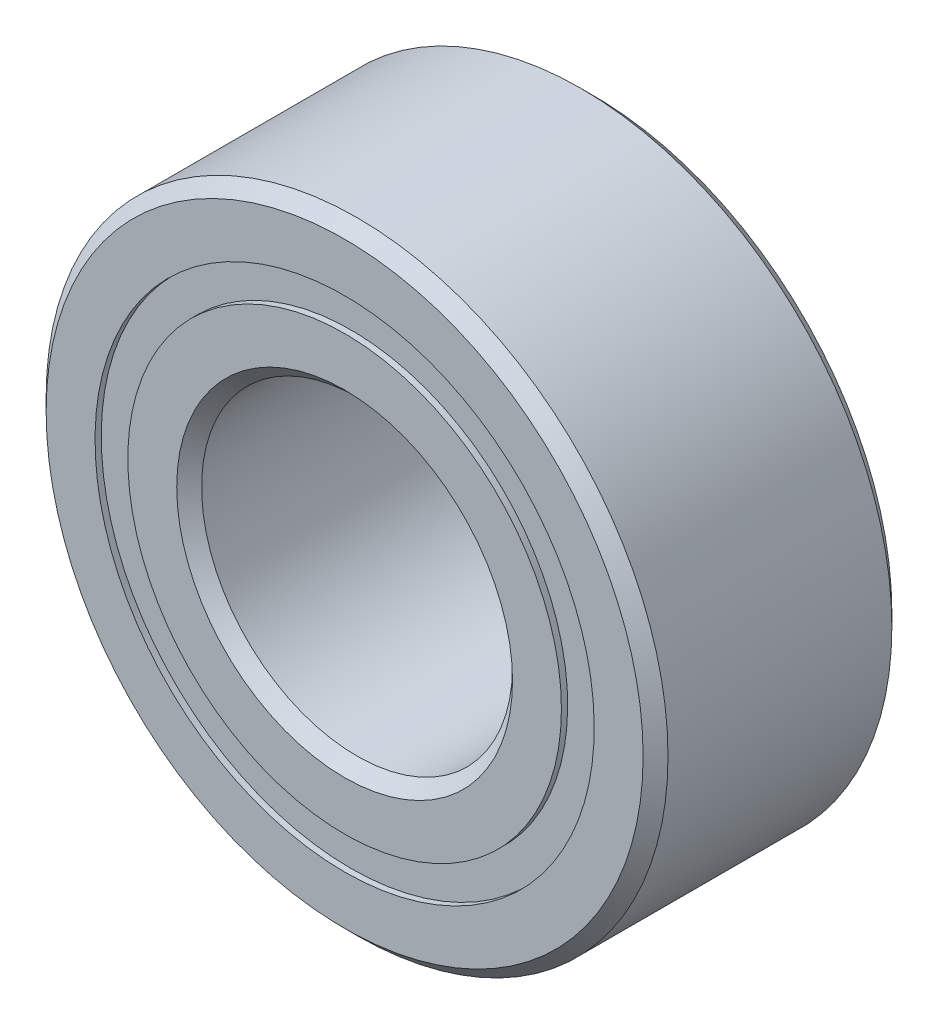
ISO-10303-21;
HEADER;
FILE_DESCRIPTION(('STEP AP214'),'2;1');
FILE_NAME('part.step','',(''),(''),'','','');
FILE_SCHEMA(('AUTOMOTIVE_DESIGN { 1 0 10303 214 1 1 1 1 }'));
ENDSEC;
DATA;
#1=APPLICATION_CONTEXT('core data for automotive mechanical design processes');
#2=APPLICATION_PROTOCOL_DEFINITION('international standard','automotive_design',2000,#1);
#3=PRODUCT_CONTEXT('',#1,'mechanical');
#4=PRODUCT('Part','Part','',(#3));
#5=PRODUCT_RELATED_PRODUCT_CATEGORY('part','',(#4));
#6=PRODUCT_DEFINITION_FORMATION('','',#4);
#7=PRODUCT_DEFINITION_CONTEXT('part definition',#1,'design');
#8=PRODUCT_DEFINITION('design','',#6,#7);
#9=PRODUCT_DEFINITION_SHAPE('','',#8);
#10=(LENGTH_UNIT() NAMED_UNIT(*) SI_UNIT(.MILLI.,.METRE.));
#11=(NAMED_UNIT(*) PLANE_ANGLE_UNIT() SI_UNIT($,.RADIAN.));
#12=(NAMED_UNIT(*) SI_UNIT($,.STERADIAN.) SOLID_ANGLE_UNIT());
#13=UNCERTAINTY_MEASURE_WITH_UNIT(LENGTH_MEASURE(1.E-05),#10,'distance_accuracy_value','');
#14=(GEOMETRIC_REPRESENTATION_CONTEXT(3) GLOBAL_UNCERTAINTY_ASSIGNED_CONTEXT((#13)) GLOBAL_UNIT_ASSIGNED_CONTEXT((#10,
#11,#12)) REPRESENTATION_CONTEXT('',''));
#15=CARTESIAN_POINT('',(0.,0.,0.));
#16=DIRECTION('',(0.,0.,1.));
#17=DIRECTION('',(1.,0.,0.));
#18=AXIS2_PLACEMENT_3D('',#15,#16,#17);
#19=CARTESIAN_POINT('',(0.,3.75,0.927189449));
#20=CARTESIAN_POINT('',(0.,5.604378898,0.927189449));
#21=CARTESIAN_POINT('',(0.,5.604378898,-0.927189449));
#22=CARTESIAN_POINT('',(0.,3.75,-0.927189449));
#23=(BOUNDED_CURVE() B_SPLINE_CURVE(3,(#19,#20,#21,#22),.UNSPECIFIED.,.F.,
.F.) B_SPLINE_CURVE_WITH_KNOTS((4,4),(0.,1.),
.UNSPECIFIED.) CURVE() GEOMETRIC_REPRESENTATION_ITEM() RATIONAL_B_SPLINE_CURVE((1.,
0.333333333333333,0.333333333333333,1.)) REPRESENTATION_ITEM(''));
#24=CARTESIAN_POINT('',(0.,3.75,0.));
#25=DIRECTION('',(0.,0.,1.));
#26=AXIS1_PLACEMENT('',#24,#25);
#27=SURFACE_OF_REVOLUTION('',#23,#26);
#28=CARTESIAN_POINT('',(0.,3.75,-0.927189449));
#29=VERTEX_POINT('',#28);
#30=VERTEX_LOOP('',#29);
#31=FACE_BOUND('',#30,.T.);
#32=CARTESIAN_POINT('',(0.,3.75,0.927189449));
#33=VERTEX_POINT('',#32);
#34=VERTEX_LOOP('',#33);
#35=FACE_BOUND('',#34,.T.);
#36=ADVANCED_FACE('P0_F15',(#31,#35),#27,.F.);
#37=CLOSED_SHELL('',(#36));
#38=MANIFOLD_SOLID_BREP('P0_B1',#37);
#39=CARTESIAN_POINT('',(0.,0.,-1.8));
#40=DIRECTION('',(0.,0.,-1.));
#41=DIRECTION('',(-1.,0.,0.));
#42=AXIS2_PLACEMENT_3D('',#39,#40,#41);
#43=CONICAL_SURFACE('',#42,2.5,0.785398163397449);
#44=CARTESIAN_POINT('',(0.,0.,-1.8));
#45=DIRECTION('',(0.,0.,1.));
#46=DIRECTION('',(1.,0.,0.));
#47=AXIS2_PLACEMENT_3D('',#44,#45,#46);
#48=CIRCLE('',#47,2.5);
#49=CARTESIAN_POINT('',(2.5,0.,-1.8));
#50=VERTEX_POINT('',#49);
#51=EDGE_CURVE('P1_E32',#50,#50,#48,.F.);
#52=ORIENTED_EDGE('',*,*,#51,.F.);
#53=EDGE_LOOP('',(#52));
#54=FACE_BOUND('',#53,.T.);
#55=CARTESIAN_POINT('',(0.,0.,-1.99999999999989));
#56=DIRECTION('',(0.,0.,-1.));
#57=DIRECTION('',(-1.,0.,0.));
#58=AXIS2_PLACEMENT_3D('',#55,#56,#57);
#59=CIRCLE('',#58,2.69999999999989);
#60=CARTESIAN_POINT('',(-2.69999999999989,0.,-1.99999999999989));
#61=VERTEX_POINT('',#60);
#62=EDGE_CURVE('P1_E17',#61,#61,#59,.F.);
#63=ORIENTED_EDGE('',*,*,#62,.F.);
#64=EDGE_LOOP('',(#63));
#65=FACE_BOUND('',#64,.T.);
#66=ADVANCED_FACE('P1_F14',(#54,#65),#43,.F.);
#67=CARTESIAN_POINT('',(0.,0.,-1.8));
#68=DIRECTION('',(0.,0.,1.));
#69=DIRECTION('',(1.,0.,0.));
#70=AXIS2_PLACEMENT_3D('',#67,#68,#69);
#71=CYLINDRICAL_SURFACE('',#70,2.5);
#72=CARTESIAN_POINT('',(0.,0.,1.80000000000002));
#73=DIRECTION('',(0.,0.,1.));
#74=DIRECTION('',(1.,0.,0.));
#75=AXIS2_PLACEMENT_3D('',#72,#73,#74);
#76=CIRCLE('',#75,2.5);
#77=CARTESIAN_POINT('',(2.5,0.,1.8));
#78=VERTEX_POINT('',#77);
#79=EDGE_CURVE('P1_E30',#78,#78,#76,.F.);
#80=ORIENTED_EDGE('',*,*,#79,.F.);
#81=EDGE_LOOP('',(#80));
#82=FACE_BOUND('',#81,.T.);
#83=ORIENTED_EDGE('',*,*,#51,.T.);
#84=EDGE_LOOP('',(#83));
#85=FACE_BOUND('',#84,.T.);
#86=ADVANCED_FACE('P1_F56',(#82,#85),#71,.F.);
#87=CARTESIAN_POINT('',(0.,2.7,-2.));
#88=DIRECTION('',(0.,0.,1.));
#89=DIRECTION('',(1.,0.,0.));
#90=AXIS2_PLACEMENT_3D('',#87,#88,#89);
#91=PLANE('',#90);
#92=ORIENTED_EDGE('',*,*,#62,.T.);
#93=EDGE_LOOP('',(#92));
#94=FACE_BOUND('',#93,.T.);
#95=CARTESIAN_POINT('',(0.,0.,-2.));
#96=DIRECTION('',(0.,0.,1.));
#97=DIRECTION('',(0.,-1.,0.));
#98=AXIS2_PLACEMENT_3D('',#95,#96,#97);
#99=CIRCLE('',#98,3.486263736);
#100=CARTESIAN_POINT('',(0.,-3.486263736,-2.));
#101=VERTEX_POINT('',#100);
#102=EDGE_CURVE('P1_E42',#101,#101,#99,.T.);
#103=ORIENTED_EDGE('',*,*,#102,.F.);
#104=EDGE_LOOP('',(#103));
#105=FACE_BOUND('',#104,.T.);
#106=ADVANCED_FACE('P1_F52',(#94,#105),#91,.F.);
#107=CARTESIAN_POINT('',(0.,0.,1.8));
#108=DIRECTION('',(0.,0.,1.));
#109=DIRECTION('',(1.,0.,0.));
#110=AXIS2_PLACEMENT_3D('',#107,#108,#109);
#111=CONICAL_SURFACE('',#110,2.5,0.785398163397449);
#112=CARTESIAN_POINT('',(0.,0.,2.));
#113=DIRECTION('',(0.,0.,1.));
#114=DIRECTION('',(1.,0.,0.));
#115=AXIS2_PLACEMENT_3D('',#112,#113,#114);
#116=CIRCLE('',#115,2.7);
#117=CARTESIAN_POINT('',(2.7,0.,2.));
#118=VERTEX_POINT('',#117);
#119=EDGE_CURVE('P1_E38',#118,#118,#116,.F.);
#120=ORIENTED_EDGE('',*,*,#119,.F.);
#121=EDGE_LOOP('',(#120));
#122=FACE_BOUND('',#121,.T.);
#123=ORIENTED_EDGE('',*,*,#79,.T.);
#124=EDGE_LOOP('',(#123));
#125=FACE_BOUND('',#124,.T.);
#126=ADVANCED_FACE('P1_F99',(#122,#125),#111,.F.);
#127=CARTESIAN_POINT('',(0.,0.,-0.888888889));
#128=DIRECTION('',(0.,0.,1.));
#129=DIRECTION('',(0.,-1.,0.));
#130=AXIS2_PLACEMENT_3D('',#127,#128,#129);
#131=CYLINDRICAL_SURFACE('',#130,3.486263736);
#132=ORIENTED_EDGE('',*,*,#102,.T.);
#133=EDGE_LOOP('',(#132));
#134=FACE_BOUND('',#133,.T.);
#135=CARTESIAN_POINT('',(0.,0.,-0.888888889207106));
#136=DIRECTION('',(0.,0.,1.));
#137=DIRECTION('',(1.,0.,0.));
#138=AXIS2_PLACEMENT_3D('',#135,#136,#137);
#139=CIRCLE('',#138,3.48626373593856);
#140=CARTESIAN_POINT('',(3.48626373593856,0.,-0.888888889207106));
#141=VERTEX_POINT('',#140);
#142=EDGE_CURVE('P1_E35',#141,#141,#139,.T.);
#143=ORIENTED_EDGE('',*,*,#142,.F.);
#144=EDGE_LOOP('',(#143));
#145=FACE_BOUND('',#144,.T.);
#146=ADVANCED_FACE('P1_F95',(#134,#145),#131,.T.);
#147=CARTESIAN_POINT('',(0.,3.486263736,2.));
#148=DIRECTION('',(0.,0.,-1.));
#149=DIRECTION('',(-1.,0.,0.));
#150=AXIS2_PLACEMENT_3D('',#147,#148,#149);
#151=PLANE('',#150);
#152=ORIENTED_EDGE('',*,*,#119,.T.);
#153=EDGE_LOOP('',(#152));
#154=FACE_BOUND('',#153,.T.);
#155=CARTESIAN_POINT('',(0.,0.,2.));
#156=DIRECTION('',(0.,0.,1.));
#157=DIRECTION('',(1.,0.,0.));
#158=AXIS2_PLACEMENT_3D('',#155,#156,#157);
#159=CIRCLE('',#158,3.486263736);
#160=CARTESIAN_POINT('',(3.486263736,0.,2.));
#161=VERTEX_POINT('',#160);
#162=EDGE_CURVE('P1_E26',#161,#161,#159,.F.);
#163=ORIENTED_EDGE('',*,*,#162,.F.);
#164=EDGE_LOOP('',(#163));
#165=FACE_BOUND('',#164,.T.);
#166=ADVANCED_FACE('P1_F91',(#154,#165),#151,.F.);
#167=CARTESIAN_POINT('',(2.82281055099999,0.,0.));
#168=CARTESIAN_POINT('',(2.822810551,0.,-0.426154839389903));
#169=CARTESIAN_POINT('',(3.0777126008668,0.,-0.767670420453381));
#170=CARTESIAN_POINT('',(3.48626373593856,0.,-0.888888889207106));
#171=(BOUNDED_CURVE() B_SPLINE_CURVE(3,(#167,#168,#169,#170),.UNSPECIFIED.,.F.,
.F.) B_SPLINE_CURVE_WITH_KNOTS((4,4),(0.,1.),
.UNSPECIFIED.) CURVE() GEOMETRIC_REPRESENTATION_ITEM() RATIONAL_B_SPLINE_CURVE((1.,
0.867592323254178,0.867592323254178,1.)) REPRESENTATION_ITEM(''));
#172=CARTESIAN_POINT('',(0.,0.,0.));
#173=DIRECTION('',(0.,0.,1.));
#174=AXIS1_PLACEMENT('',#172,#173);
#175=SURFACE_OF_REVOLUTION('',#171,#174);
#176=ORIENTED_EDGE('',*,*,#142,.T.);
#177=EDGE_LOOP('',(#176));
#178=FACE_BOUND('',#177,.T.);
#179=CARTESIAN_POINT('',(0.,0.,0.));
#180=DIRECTION('',(0.,0.,1.));
#181=DIRECTION('',(1.,0.,0.));
#182=AXIS2_PLACEMENT_3D('',#179,#180,#181);
#183=CIRCLE('',#182,2.822810551);
#184=CARTESIAN_POINT('',(2.822810551,0.,0.));
#185=VERTEX_POINT('',#184);
#186=EDGE_CURVE('P1_E21',#185,#185,#183,.T.);
#187=ORIENTED_EDGE('',*,*,#186,.F.);
#188=EDGE_LOOP('',(#187));
#189=FACE_BOUND('',#188,.T.);
#190=ADVANCED_FACE('P1_F72',(#178,#189),#175,.F.);
#191=CARTESIAN_POINT('',(0.,0.,2.));
#192=DIRECTION('',(0.,0.,1.));
#193=DIRECTION('',(1.,0.,0.));
#194=AXIS2_PLACEMENT_3D('',#191,#192,#193);
#195=CYLINDRICAL_SURFACE('',#194,3.486263736);
#196=CARTESIAN_POINT('',(0.,0.,0.888888889207101));
#197=DIRECTION('',(0.,0.,1.));
#198=DIRECTION('',(1.,0.,0.));
#199=AXIS2_PLACEMENT_3D('',#196,#197,#198);
#200=CIRCLE('',#199,3.48626373593855);
#201=CARTESIAN_POINT('',(3.48626373593855,0.,0.888888889207101));
#202=VERTEX_POINT('',#201);
#203=EDGE_CURVE('P1_E10',#202,#202,#200,.F.);
#204=ORIENTED_EDGE('',*,*,#203,.F.);
#205=EDGE_LOOP('',(#204));
#206=FACE_BOUND('',#205,.T.);
#207=ORIENTED_EDGE('',*,*,#162,.T.);
#208=EDGE_LOOP('',(#207));
#209=FACE_BOUND('',#208,.T.);
#210=ADVANCED_FACE('P1_F66',(#206,#209),#195,.T.);
#211=CARTESIAN_POINT('',(3.48626373615065,0.,0.888888889270032));
#212=CARTESIAN_POINT('',(3.07771260104997,0.,0.767670420613788));
#213=CARTESIAN_POINT('',(2.82281055110169,0.,0.426154839611129));
#214=CARTESIAN_POINT('',(2.822810551,0.,2.21240981424841E-10));
#215=(BOUNDED_CURVE() B_SPLINE_CURVE(3,(#211,#212,#213,#214),.UNSPECIFIED.,.F.,
.F.) B_SPLINE_CURVE_WITH_KNOTS((4,4),(0.,1.),
.UNSPECIFIED.) CURVE() GEOMETRIC_REPRESENTATION_ITEM() RATIONAL_B_SPLINE_CURVE((1.,
0.867592323254178,0.867592323254178,1.)) REPRESENTATION_ITEM(''));
#216=CARTESIAN_POINT('',(0.,0.,0.));
#217=DIRECTION('',(0.,0.,1.));
#218=AXIS1_PLACEMENT('',#216,#217);
#219=SURFACE_OF_REVOLUTION('',#215,#218);
#220=ORIENTED_EDGE('',*,*,#186,.T.);
#221=EDGE_LOOP('',(#220));
#222=FACE_BOUND('',#221,.T.);
#223=ORIENTED_EDGE('',*,*,#203,.T.);
#224=EDGE_LOOP('',(#223));
#225=FACE_BOUND('',#224,.T.);
#226=ADVANCED_FACE('P1_F64',(#222,#225),#219,.F.);
#227=CLOSED_SHELL('',(#66,#86,#106,#126,#146,#166,#190,#210,#226));
#228=MANIFOLD_SOLID_BREP('P1_B1',#227);
#229=CARTESIAN_POINT('',(0.,0.,-1.8));
#230=DIRECTION('',(0.,0.,1.));
#231=DIRECTION('',(1.,0.,0.));
#232=AXIS2_PLACEMENT_3D('',#229,#230,#231);
#233=CONICAL_SURFACE('',#232,5.,0.78539816339745);
#234=CARTESIAN_POINT('',(0.,0.,-1.8));
#235=DIRECTION('',(0.,0.,1.));
#236=DIRECTION('',(1.,0.,0.));
#237=AXIS2_PLACEMENT_3D('',#234,#235,#236);
#238=CIRCLE('',#237,5.);
#239=CARTESIAN_POINT('',(5.,0.,-1.8));
#240=VERTEX_POINT('',#239);
#241=EDGE_CURVE('P2_E30',#240,#240,#238,.T.);
#242=ORIENTED_EDGE('',*,*,#241,.F.);
#243=EDGE_LOOP('',(#242));
#244=FACE_BOUND('',#243,.T.);
#245=CARTESIAN_POINT('',(0.,0.,-2.));
#246=DIRECTION('',(0.,0.,1.));
#247=DIRECTION('',(1.,0.,0.));
#248=AXIS2_PLACEMENT_3D('',#245,#246,#247);
#249=CIRCLE('',#248,4.8);
#250=CARTESIAN_POINT('',(4.8,0.,-2.));
#251=VERTEX_POINT('',#250);
#252=EDGE_CURVE('P2_E17',#251,#251,#249,.F.);
#253=ORIENTED_EDGE('',*,*,#252,.F.);
#254=EDGE_LOOP('',(#253));
#255=FACE_BOUND('',#254,.T.);
#256=ADVANCED_FACE('P2_F14',(#244,#255),#233,.T.);
#257=CARTESIAN_POINT('',(0.,4.8,-2.));
#258=DIRECTION('',(0.,0.,1.));
#259=DIRECTION('',(1.,0.,0.));
#260=AXIS2_PLACEMENT_3D('',#257,#258,#259);
#261=PLANE('',#260);
#262=CARTESIAN_POINT('',(0.,0.,-2.));
#263=DIRECTION('',(0.,0.,1.));
#264=DIRECTION('',(1.,0.,0.));
#265=AXIS2_PLACEMENT_3D('',#262,#263,#264);
#266=CIRCLE('',#265,4.013736264);
#267=CARTESIAN_POINT('',(4.013736264,0.,-2.));
#268=VERTEX_POINT('',#267);
#269=EDGE_CURVE('P2_E34',#268,#268,#266,.F.);
#270=ORIENTED_EDGE('',*,*,#269,.F.);
#271=EDGE_LOOP('',(#270));
#272=FACE_BOUND('',#271,.T.);
#273=ORIENTED_EDGE('',*,*,#252,.T.);
#274=EDGE_LOOP('',(#273));
#275=FACE_BOUND('',#274,.T.);
#276=ADVANCED_FACE('P2_F46',(#272,#275),#261,.F.);
#277=CARTESIAN_POINT('',(0.,0.,1.8));
#278=DIRECTION('',(0.,0.,1.));
#279=DIRECTION('',(1.,0.,0.));
#280=AXIS2_PLACEMENT_3D('',#277,#278,#279);
#281=CYLINDRICAL_SURFACE('',#280,5.);
#282=CARTESIAN_POINT('',(0.,0.,1.80000000000002));
#283=DIRECTION('',(0.,0.,-1.));
#284=DIRECTION('',(-1.,0.,0.));
#285=AXIS2_PLACEMENT_3D('',#282,#283,#284);
#286=CIRCLE('',#285,5.);
#287=CARTESIAN_POINT('',(-5.,0.,1.8));
#288=VERTEX_POINT('',#287);
#289=EDGE_CURVE('P2_E36',#288,#288,#286,.F.);
#290=ORIENTED_EDGE('',*,*,#289,.F.);
#291=EDGE_LOOP('',(#290));
#292=FACE_BOUND('',#291,.T.);
#293=ORIENTED_EDGE('',*,*,#241,.T.);
#294=EDGE_LOOP('',(#293));
#295=FACE_BOUND('',#294,.T.);
#296=ADVANCED_FACE('P2_F54',(#292,#295),#281,.T.);
#297=CARTESIAN_POINT('',(0.,0.,-2.));
#298=DIRECTION('',(0.,0.,1.));
#299=DIRECTION('',(1.,0.,0.));
#300=AXIS2_PLACEMENT_3D('',#297,#298,#299);
#301=CYLINDRICAL_SURFACE('',#300,4.013736264);
#302=CARTESIAN_POINT('',(0.,0.,-0.888888889207103));
#303=DIRECTION('',(0.,0.,1.));
#304=DIRECTION('',(1.,0.,0.));
#305=AXIS2_PLACEMENT_3D('',#302,#303,#304);
#306=CIRCLE('',#305,4.01373626406145);
#307=CARTESIAN_POINT('',(4.01373626406145,0.,-0.888888889207103));
#308=VERTEX_POINT('',#307);
#309=EDGE_CURVE('P2_E33',#308,#308,#306,.F.);
#310=ORIENTED_EDGE('',*,*,#309,.F.);
#311=EDGE_LOOP('',(#310));
#312=FACE_BOUND('',#311,.T.);
#313=ORIENTED_EDGE('',*,*,#269,.T.);
#314=EDGE_LOOP('',(#313));
#315=FACE_BOUND('',#314,.T.);
#316=ADVANCED_FACE('P2_F85',(#312,#315),#301,.F.);
#317=CARTESIAN_POINT('',(0.,0.,1.8));
#318=DIRECTION('',(0.,0.,-1.));
#319=DIRECTION('',(-1.,0.,0.));
#320=AXIS2_PLACEMENT_3D('',#317,#318,#319);
#321=CONICAL_SURFACE('',#320,5.,0.78539816339745);
#322=ORIENTED_EDGE('',*,*,#289,.T.);
#323=EDGE_LOOP('',(#322));
#324=FACE_BOUND('',#323,.T.);
#325=CARTESIAN_POINT('',(0.,0.,2.));
#326=DIRECTION('',(0.,0.,-1.));
#327=DIRECTION('',(-1.,0.,0.));
#328=AXIS2_PLACEMENT_3D('',#325,#326,#327);
#329=CIRCLE('',#328,4.8);
#330=CARTESIAN_POINT('',(-4.8,0.,2.));
#331=VERTEX_POINT('',#330);
#332=EDGE_CURVE('P2_E26',#331,#331,#329,.F.);
#333=ORIENTED_EDGE('',*,*,#332,.F.);
#334=EDGE_LOOP('',(#333));
#335=FACE_BOUND('',#334,.T.);
#336=ADVANCED_FACE('P2_F71',(#324,#335),#321,.T.);
#337=CARTESIAN_POINT('',(4.01373626384937,0.,-0.888888889270028));
#338=CARTESIAN_POINT('',(5.1000689931863,0.,-0.566570387159054));
#339=CARTESIAN_POINT('',(5.10006899296233,0.,0.566570387692722));
#340=CARTESIAN_POINT('',(4.013736263498,0.,0.888888889374279));
#341=(BOUNDED_CURVE() B_SPLINE_CURVE(3,(#337,#338,#339,#340),.UNSPECIFIED.,.F.,
.F.) B_SPLINE_CURVE_WITH_KNOTS((4,4),(0.,1.),
.UNSPECIFIED.) CURVE() GEOMETRIC_REPRESENTATION_ITEM() RATIONAL_B_SPLINE_CURVE((1.,
0.522964671321577,0.522964671321577,1.)) REPRESENTATION_ITEM(''));
#342=CARTESIAN_POINT('',(0.,0.,0.));
#343=DIRECTION('',(0.,0.,1.));
#344=AXIS1_PLACEMENT('',#342,#343);
#345=SURFACE_OF_REVOLUTION('',#341,#344);
#346=CARTESIAN_POINT('',(0.,0.,0.888888889));
#347=DIRECTION('',(0.,0.,1.));
#348=DIRECTION('',(1.,0.,0.));
#349=AXIS2_PLACEMENT_3D('',#346,#347,#348);
#350=CIRCLE('',#349,4.013736264);
#351=CARTESIAN_POINT('',(4.013736264,0.,0.888888889));
#352=VERTEX_POINT('',#351);
#353=EDGE_CURVE('P2_E21',#352,#352,#350,.F.);
#354=ORIENTED_EDGE('',*,*,#353,.F.);
#355=EDGE_LOOP('',(#354));
#356=FACE_BOUND('',#355,.T.);
#357=ORIENTED_EDGE('',*,*,#309,.T.);
#358=EDGE_LOOP('',(#357));
#359=FACE_BOUND('',#358,.T.);
#360=ADVANCED_FACE('P2_F64',(#356,#359),#345,.F.);
#361=CARTESIAN_POINT('',(0.,4.8,2.));
#362=DIRECTION('',(0.,0.,-1.));
#363=DIRECTION('',(-1.,0.,0.));
#364=AXIS2_PLACEMENT_3D('',#361,#362,#363);
#365=PLANE('',#364);
#366=CARTESIAN_POINT('',(0.,0.,2.));
#367=DIRECTION('',(0.,0.,1.));
#368=DIRECTION('',(0.,-1.,0.));
#369=AXIS2_PLACEMENT_3D('',#366,#367,#368);
#370=CIRCLE('',#369,4.013736264);
#371=CARTESIAN_POINT('',(0.,-4.013736264,2.));
#372=VERTEX_POINT('',#371);
#373=EDGE_CURVE('P2_E10',#372,#372,#370,.T.);
#374=ORIENTED_EDGE('',*,*,#373,.F.);
#375=EDGE_LOOP('',(#374));
#376=FACE_BOUND('',#375,.T.);
#377=ORIENTED_EDGE('',*,*,#332,.T.);
#378=EDGE_LOOP('',(#377));
#379=FACE_BOUND('',#378,.T.);
#380=ADVANCED_FACE('P2_F58',(#376,#379),#365,.F.);
#381=CARTESIAN_POINT('',(0.,0.,0.888888889));
#382=DIRECTION('',(0.,0.,1.));
#383=DIRECTION('',(0.,-1.,0.));
#384=AXIS2_PLACEMENT_3D('',#381,#382,#383);
#385=CYLINDRICAL_SURFACE('',#384,4.013736264);
#386=ORIENTED_EDGE('',*,*,#353,.T.);
#387=EDGE_LOOP('',(#386));
#388=FACE_BOUND('',#387,.T.);
#389=ORIENTED_EDGE('',*,*,#373,.T.);
#390=EDGE_LOOP('',(#389));
#391=FACE_BOUND('',#390,.T.);
#392=ADVANCED_FACE('P2_F56',(#388,#391),#385,.F.);
#393=CLOSED_SHELL('',(#256,#276,#296,#316,#336,#360,#380,#392));
#394=MANIFOLD_SOLID_BREP('P2_B1',#393);
#395=CARTESIAN_POINT('',(0.,0.,-1.9));
#396=DIRECTION('',(0.,0.,1.));
#397=DIRECTION('',(0.,-1.,0.));
#398=AXIS2_PLACEMENT_3D('',#395,#396,#397);
#399=CYLINDRICAL_SURFACE('',#398,3.486263736);
#400=CARTESIAN_POINT('',(0.,0.,-0.927189449));
#401=DIRECTION('',(0.,0.,1.));
#402=DIRECTION('',(0.,-1.,0.));
#403=AXIS2_PLACEMENT_3D('',#400,#401,#402);
#404=CIRCLE('',#403,3.486263736);
#405=CARTESIAN_POINT('',(0.,-3.486263736,-0.927189449));
#406=VERTEX_POINT('',#405);
#407=EDGE_CURVE('P3_E26',#406,#406,#404,.F.);
#408=ORIENTED_EDGE('',*,*,#407,.F.);
#409=EDGE_LOOP('',(#408));
#410=FACE_BOUND('',#409,.T.);
#411=CARTESIAN_POINT('',(0.,0.,-1.9));
#412=DIRECTION('',(0.,0.,1.));
#413=DIRECTION('',(0.,-1.,0.));
#414=AXIS2_PLACEMENT_3D('',#411,#412,#413);
#415=CIRCLE('',#414,3.486263736);
#416=CARTESIAN_POINT('',(0.,-3.486263736,-1.9));
#417=VERTEX_POINT('',#416);
#418=EDGE_CURVE('P3_E17',#417,#417,#415,.T.);
#419=ORIENTED_EDGE('',*,*,#418,.F.);
#420=EDGE_LOOP('',(#419));
#421=FACE_BOUND('',#420,.T.);
#422=ADVANCED_FACE('P3_F14',(#410,#421),#399,.F.);
#423=CARTESIAN_POINT('',(0.,4.013736264,-1.9));
#424=DIRECTION('',(0.,0.,1.));
#425=DIRECTION('',(1.,0.,0.));
#426=AXIS2_PLACEMENT_3D('',#423,#424,#425);
#427=PLANE('',#426);
#428=ORIENTED_EDGE('',*,*,#418,.T.);
#429=EDGE_LOOP('',(#428));
#430=FACE_BOUND('',#429,.T.);
#431=CARTESIAN_POINT('',(0.,0.,-1.9));
#432=DIRECTION('',(0.,0.,1.));
#433=DIRECTION('',(0.,-1.,0.));
#434=AXIS2_PLACEMENT_3D('',#431,#432,#433);
#435=CIRCLE('',#434,4.013736264);
#436=CARTESIAN_POINT('',(0.,-4.013736264,-1.9));
#437=VERTEX_POINT('',#436);
#438=EDGE_CURVE('P3_E21',#437,#437,#435,.T.);
#439=ORIENTED_EDGE('',*,*,#438,.F.);
#440=EDGE_LOOP('',(#439));
#441=FACE_BOUND('',#440,.T.);
#442=ADVANCED_FACE('P3_F34',(#430,#441),#427,.F.);
#443=CARTESIAN_POINT('',(0.,4.013736264,-0.927189449));
#444=DIRECTION('',(0.,0.,-1.));
#445=DIRECTION('',(-1.,0.,0.));
#446=AXIS2_PLACEMENT_3D('',#443,#444,#445);
#447=PLANE('',#446);
#448=ORIENTED_EDGE('',*,*,#407,.T.);
#449=EDGE_LOOP('',(#448));
#450=FACE_BOUND('',#449,.T.);
#451=CARTESIAN_POINT('',(0.,0.,-0.927189449));
#452=DIRECTION('',(0.,0.,1.));
#453=DIRECTION('',(0.,-1.,0.));
#454=AXIS2_PLACEMENT_3D('',#451,#452,#453);
#455=CIRCLE('',#454,4.013736264);
#456=CARTESIAN_POINT('',(0.,-4.013736264,-0.927189449));
#457=VERTEX_POINT('',#456);
#458=EDGE_CURVE('P3_E10',#457,#457,#455,.F.);
#459=ORIENTED_EDGE('',*,*,#458,.F.);
#460=EDGE_LOOP('',(#459));
#461=FACE_BOUND('',#460,.T.);
#462=ADVANCED_FACE('P3_F43',(#450,#461),#447,.F.);
#463=CARTESIAN_POINT('',(0.,0.,-0.927189449));
#464=DIRECTION('',(0.,0.,1.));
#465=DIRECTION('',(0.,-1.,0.));
#466=AXIS2_PLACEMENT_3D('',#463,#464,#465);
#467=CYLINDRICAL_SURFACE('',#466,4.013736264);
#468=ORIENTED_EDGE('',*,*,#438,.T.);
#469=EDGE_LOOP('',(#468));
#470=FACE_BOUND('',#469,.T.);
#471=ORIENTED_EDGE('',*,*,#458,.T.);
#472=EDGE_LOOP('',(#471));
#473=FACE_BOUND('',#472,.T.);
#474=ADVANCED_FACE('P3_F44',(#470,#473),#467,.T.);
#475=CLOSED_SHELL('',(#422,#442,#462,#474));
#476=MANIFOLD_SOLID_BREP('P3_B1',#475);
#477=CARTESIAN_POINT('',(0.,0.,0.927189449));
#478=DIRECTION('',(0.,0.,1.));
#479=DIRECTION('',(0.,-1.,0.));
#480=AXIS2_PLACEMENT_3D('',#477,#478,#479);
#481=CYLINDRICAL_SURFACE('',#480,3.486263736);
#482=CARTESIAN_POINT('',(0.,0.,1.9));
#483=DIRECTION('',(0.,0.,1.));
#484=DIRECTION('',(0.,-1.,0.));
#485=AXIS2_PLACEMENT_3D('',#482,#483,#484);
#486=CIRCLE('',#485,3.486263736);
#487=CARTESIAN_POINT('',(0.,-3.486263736,1.9));
#488=VERTEX_POINT('',#487);
#489=EDGE_CURVE('P4_E26',#488,#488,#486,.F.);
#490=ORIENTED_EDGE('',*,*,#489,.F.);
#491=EDGE_LOOP('',(#490));
#492=FACE_BOUND('',#491,.T.);
#493=CARTESIAN_POINT('',(0.,0.,0.927189449));
#494=DIRECTION('',(0.,0.,1.));
#495=DIRECTION('',(0.,-1.,0.));
#496=AXIS2_PLACEMENT_3D('',#493,#494,#495);
#497=CIRCLE('',#496,3.486263736);
#498=CARTESIAN_POINT('',(0.,-3.486263736,0.927189449));
#499=VERTEX_POINT('',#498);
#500=EDGE_CURVE('P4_E17',#499,#499,#497,.T.);
#501=ORIENTED_EDGE('',*,*,#500,.F.);
#502=EDGE_LOOP('',(#501));
#503=FACE_BOUND('',#502,.T.);
#504=ADVANCED_FACE('P4_F14',(#492,#503),#481,.F.);
#505=CARTESIAN_POINT('',(0.,4.013736264,0.927189449));
#506=DIRECTION('',(0.,0.,1.));
#507=DIRECTION('',(1.,0.,0.));
#508=AXIS2_PLACEMENT_3D('',#505,#506,#507);
#509=PLANE('',#508);
#510=ORIENTED_EDGE('',*,*,#500,.T.);
#511=EDGE_LOOP('',(#510));
#512=FACE_BOUND('',#511,.T.);
#513=CARTESIAN_POINT('',(0.,0.,0.927189449));
#514=DIRECTION('',(0.,0.,1.));
#515=DIRECTION('',(0.,-1.,0.));
#516=AXIS2_PLACEMENT_3D('',#513,#514,#515);
#517=CIRCLE('',#516,4.013736264);
#518=CARTESIAN_POINT('',(0.,-4.013736264,0.927189449));
#519=VERTEX_POINT('',#518);
#520=EDGE_CURVE('P4_E21',#519,#519,#517,.T.);
#521=ORIENTED_EDGE('',*,*,#520,.F.);
#522=EDGE_LOOP('',(#521));
#523=FACE_BOUND('',#522,.T.);
#524=ADVANCED_FACE('P4_F34',(#512,#523),#509,.F.);
#525=CARTESIAN_POINT('',(0.,4.013736264,1.9));
#526=DIRECTION('',(0.,0.,-1.));
#527=DIRECTION('',(-1.,0.,0.));
#528=AXIS2_PLACEMENT_3D('',#525,#526,#527);
#529=PLANE('',#528);
#530=ORIENTED_EDGE('',*,*,#489,.T.);
#531=EDGE_LOOP('',(#530));
#532=FACE_BOUND('',#531,.T.);
#533=CARTESIAN_POINT('',(0.,0.,1.9));
#534=DIRECTION('',(0.,0.,1.));
#535=DIRECTION('',(0.,-1.,0.));
#536=AXIS2_PLACEMENT_3D('',#533,#534,#535);
#537=CIRCLE('',#536,4.013736264);
#538=CARTESIAN_POINT('',(0.,-4.013736264,1.9));
#539=VERTEX_POINT('',#538);
#540=EDGE_CURVE('P4_E10',#539,#539,#537,.F.);
#541=ORIENTED_EDGE('',*,*,#540,.F.);
#542=EDGE_LOOP('',(#541));
#543=FACE_BOUND('',#542,.T.);
#544=ADVANCED_FACE('P4_F43',(#532,#543),#529,.F.);
#545=CARTESIAN_POINT('',(0.,0.,1.9));
#546=DIRECTION('',(0.,0.,1.));
#547=DIRECTION('',(0.,-1.,0.));
#548=AXIS2_PLACEMENT_3D('',#545,#546,#547);
#549=CYLINDRICAL_SURFACE('',#548,4.013736264);
#550=ORIENTED_EDGE('',*,*,#520,.T.);
#551=EDGE_LOOP('',(#550));
#552=FACE_BOUND('',#551,.T.);
#553=ORIENTED_EDGE('',*,*,#540,.T.);
#554=EDGE_LOOP('',(#553));
#555=FACE_BOUND('',#554,.T.);
#556=ADVANCED_FACE('P4_F44',(#552,#555),#549,.T.);
#557=CLOSED_SHELL('',(#504,#524,#544,#556));
#558=MANIFOLD_SOLID_BREP('P4_B1',#557);
#559=CARTESIAN_POINT('',(-1.87499999990412,3.24759526402568,0.927189448999961));
#560=CARTESIAN_POINT('',(-2.8021894489041,4.85353449793548,0.927189448999963));
#561=CARTESIAN_POINT('',(-2.80218944890411,4.85353449793549,-0.927189449000039));
#562=CARTESIAN_POINT('',(-1.87499999990412,3.24759526402568,-0.927189449000039));
#563=(BOUNDED_CURVE() B_SPLINE_CURVE(3,(#559,#560,#561,#562),.UNSPECIFIED.,.F.,
.F.) B_SPLINE_CURVE_WITH_KNOTS((4,4),(0.,1.),
.UNSPECIFIED.) CURVE() GEOMETRIC_REPRESENTATION_ITEM() RATIONAL_B_SPLINE_CURVE((1.,
0.333333333333333,0.333333333333333,1.)) REPRESENTATION_ITEM(''));
#564=CARTESIAN_POINT('',(-1.875,3.247595264,0.));
#565=DIRECTION('',(0.,0.,1.));
#566=AXIS1_PLACEMENT('',#564,#565);
#567=SURFACE_OF_REVOLUTION('',#563,#566);
#568=CARTESIAN_POINT('',(-1.875,3.247595264,-0.927189449000039));
#569=VERTEX_POINT('',#568);
#570=VERTEX_LOOP('',#569);
#571=FACE_BOUND('',#570,.T.);
#572=CARTESIAN_POINT('',(-1.875,3.247595264,0.927189448999961));
#573=VERTEX_POINT('',#572);
#574=VERTEX_LOOP('',#573);
#575=FACE_BOUND('',#574,.T.);
#576=ADVANCED_FACE('P5_F15',(#571,#575),#567,.F.);
#577=CLOSED_SHELL('',(#576));
#578=MANIFOLD_SOLID_BREP('P5_B1',#577);
#579=CARTESIAN_POINT('',(-3.24759526419159,1.87500000000002,0.927189448191621));
#580=CARTESIAN_POINT('',(-4.85353449636932,2.80218944800004,0.927189448191621));
#581=CARTESIAN_POINT('',(-4.85353449636932,2.80218944800004,-0.927189447808381));
#582=CARTESIAN_POINT('',(-3.24759526419159,1.87500000000002,-0.927189447808381));
#583=(BOUNDED_CURVE() B_SPLINE_CURVE(3,(#579,#580,#581,#582),.UNSPECIFIED.,.F.,
.F.) B_SPLINE_CURVE_WITH_KNOTS((4,4),(0.,1.),
.UNSPECIFIED.) CURVE() GEOMETRIC_REPRESENTATION_ITEM() RATIONAL_B_SPLINE_CURVE((1.,
0.333333333333333,0.333333333333333,1.)) REPRESENTATION_ITEM(''));
#584=CARTESIAN_POINT('',(-3.247595264,1.875,0.));
#585=DIRECTION('',(0.,0.,1.));
#586=AXIS1_PLACEMENT('',#584,#585);
#587=SURFACE_OF_REVOLUTION('',#583,#586);
#588=CARTESIAN_POINT('',(-3.247595264,1.87499999999996,-0.927189447808381));
#589=VERTEX_POINT('',#588);
#590=VERTEX_LOOP('',#589);
#591=FACE_BOUND('',#590,.T.);
#592=CARTESIAN_POINT('',(-3.247595264,1.87500000000004,0.927189448191621));
#593=VERTEX_POINT('',#592);
#594=VERTEX_LOOP('',#593);
#595=FACE_BOUND('',#594,.T.);
#596=ADVANCED_FACE('P6_F15',(#591,#595),#587,.F.);
#597=CLOSED_SHELL('',(#596));
#598=MANIFOLD_SOLID_BREP('P6_B1',#597);
#599=CARTESIAN_POINT('',(-3.74999999999996,0.,0.927189449));
#600=CARTESIAN_POINT('',(-5.60437889799996,0.,0.927189448999999));
#601=CARTESIAN_POINT('',(-5.60437889799996,0.,-0.927189449));
#602=CARTESIAN_POINT('',(-3.74999999999996,0.,-0.927189449));
#603=(BOUNDED_CURVE() B_SPLINE_CURVE(3,(#599,#600,#601,#602),.UNSPECIFIED.,.F.,
.F.) B_SPLINE_CURVE_WITH_KNOTS((4,4),(0.,1.),
.UNSPECIFIED.) CURVE() GEOMETRIC_REPRESENTATION_ITEM() RATIONAL_B_SPLINE_CURVE((1.,
0.333333333333334,0.333333333333334,1.)) REPRESENTATION_ITEM(''));
#604=CARTESIAN_POINT('',(-3.75,0.,0.));
#605=DIRECTION('',(0.,0.,1.));
#606=AXIS1_PLACEMENT('',#604,#605);
#607=SURFACE_OF_REVOLUTION('',#603,#606);
#608=CARTESIAN_POINT('',(-3.75,0.,-0.927189449));
#609=VERTEX_POINT('',#608);
#610=VERTEX_LOOP('',#609);
#611=FACE_BOUND('',#610,.T.);
#612=CARTESIAN_POINT('',(-3.75,0.,0.927189449));
#613=VERTEX_POINT('',#612);
#614=VERTEX_LOOP('',#613);
#615=FACE_BOUND('',#614,.T.);
#616=ADVANCED_FACE('P7_F15',(#611,#615),#607,.F.);
#617=CLOSED_SHELL('',(#616));
#618=MANIFOLD_SOLID_BREP('P7_B1',#617);
#619=CARTESIAN_POINT('',(-3.24759526419164,-1.87499999999995,0.92718944819166));
#620=CARTESIAN_POINT('',(-4.85353449636939,-2.80218944799994,0.927189448191661));
#621=CARTESIAN_POINT('',(-4.85353449636939,-2.80218944799994,-0.92718944780834));
#622=CARTESIAN_POINT('',(-3.24759526419164,-1.87499999999996,-0.927189447808342));
#623=(BOUNDED_CURVE() B_SPLINE_CURVE(3,(#619,#620,#621,#622),.UNSPECIFIED.,.F.,
.F.) B_SPLINE_CURVE_WITH_KNOTS((4,4),(0.,1.),
.UNSPECIFIED.) CURVE() GEOMETRIC_REPRESENTATION_ITEM() RATIONAL_B_SPLINE_CURVE((1.,
0.333333333333334,0.333333333333334,1.)) REPRESENTATION_ITEM(''));
#624=CARTESIAN_POINT('',(-3.247595264,-1.875,0.));
#625=DIRECTION('',(0.,0.,1.));
#626=AXIS1_PLACEMENT('',#624,#625);
#627=SURFACE_OF_REVOLUTION('',#623,#626);
#628=CARTESIAN_POINT('',(-3.247595264,-1.875,-0.927189447808342));
#629=VERTEX_POINT('',#628);
#630=VERTEX_LOOP('',#629);
#631=FACE_BOUND('',#630,.T.);
#632=CARTESIAN_POINT('',(-3.247595264,-1.875,0.92718944819166));
#633=VERTEX_POINT('',#632);
#634=VERTEX_LOOP('',#633);
#635=FACE_BOUND('',#634,.T.);
#636=ADVANCED_FACE('P8_F15',(#631,#635),#627,.F.);
#637=CLOSED_SHELL('',(#636));
#638=MANIFOLD_SOLID_BREP('P8_B1',#637);
#639=CARTESIAN_POINT('',(-1.87500000009584,-3.24759526435758,0.927189449000031));
#640=CARTESIAN_POINT('',(-2.80218944909585,-4.85353449826737,0.92718944900003));
#641=CARTESIAN_POINT('',(-2.80218944909585,-4.85353449826737,-0.927189448999969));
#642=CARTESIAN_POINT('',(-1.87500000009584,-3.24759526435758,-0.927189448999969));
#643=(BOUNDED_CURVE() B_SPLINE_CURVE(3,(#639,#640,#641,#642),.UNSPECIFIED.,.F.,
.F.) B_SPLINE_CURVE_WITH_KNOTS((4,4),(0.,1.),
.UNSPECIFIED.) CURVE() GEOMETRIC_REPRESENTATION_ITEM() RATIONAL_B_SPLINE_CURVE((1.,
0.333333333333334,0.333333333333334,1.)) REPRESENTATION_ITEM(''));
#644=CARTESIAN_POINT('',(-1.875,-3.247595264,0.));
#645=DIRECTION('',(0.,0.,1.));
#646=AXIS1_PLACEMENT('',#644,#645);
#647=SURFACE_OF_REVOLUTION('',#643,#646);
#648=CARTESIAN_POINT('',(-1.875,-3.247595264,-0.927189448999969));
#649=VERTEX_POINT('',#648);
#650=VERTEX_LOOP('',#649);
#651=FACE_BOUND('',#650,.T.);
#652=CARTESIAN_POINT('',(-1.875,-3.247595264,0.927189449000031));
#653=VERTEX_POINT('',#652);
#654=VERTEX_LOOP('',#653);
#655=FACE_BOUND('',#654,.T.);
#656=ADVANCED_FACE('P9_F15',(#651,#655),#647,.F.);
#657=CLOSED_SHELL('',(#656));
#658=MANIFOLD_SOLID_BREP('P9_B1',#657);
#659=CARTESIAN_POINT('',(0.,-3.75000000000001,0.927189449000026));
#660=CARTESIAN_POINT('',(0.,-5.60437889800001,0.927189449000013));
#661=CARTESIAN_POINT('',(0.,-5.60437889799999,-0.927189448999985));
#662=CARTESIAN_POINT('',(0.,-3.74999999999999,-0.927189448999974));
#663=(BOUNDED_CURVE() B_SPLINE_CURVE(3,(#659,#660,#661,#662),.UNSPECIFIED.,.F.,
.F.) B_SPLINE_CURVE_WITH_KNOTS((4,4),(0.,1.),
.UNSPECIFIED.) CURVE() GEOMETRIC_REPRESENTATION_ITEM() RATIONAL_B_SPLINE_CURVE((1.,
0.333333333333334,0.333333333333334,1.)) REPRESENTATION_ITEM(''));
#664=CARTESIAN_POINT('',(0.,-3.75,0.));
#665=DIRECTION('',(0.,0.,1.));
#666=AXIS1_PLACEMENT('',#664,#665);
#667=SURFACE_OF_REVOLUTION('',#663,#666);
#668=CARTESIAN_POINT('',(0.,-3.75,-0.927189448999974));
#669=VERTEX_POINT('',#668);
#670=VERTEX_LOOP('',#669);
#671=FACE_BOUND('',#670,.T.);
#672=CARTESIAN_POINT('',(0.,-3.75,0.927189449000026));
#673=VERTEX_POINT('',#672);
#674=VERTEX_LOOP('',#673);
#675=FACE_BOUND('',#674,.T.);
#676=ADVANCED_FACE('P10_F15',(#671,#675),#667,.F.);
#677=CLOSED_SHELL('',(#676));
#678=MANIFOLD_SOLID_BREP('P10_B1',#677);
#679=CARTESIAN_POINT('',(1.87500000009581,-3.24759526435764,0.927189449000014));
#680=CARTESIAN_POINT('',(2.80218944909581,-4.85353449826744,0.927189448999989));
#681=CARTESIAN_POINT('',(2.80218944909579,-4.85353449826742,-0.927189449000011));
#682=CARTESIAN_POINT('',(1.8750000000958,-3.24759526435762,-0.927189448999985));
#683=(BOUNDED_CURVE() B_SPLINE_CURVE(3,(#679,#680,#681,#682),.UNSPECIFIED.,.F.,
.F.) B_SPLINE_CURVE_WITH_KNOTS((4,4),(0.,1.),
.UNSPECIFIED.) CURVE() GEOMETRIC_REPRESENTATION_ITEM() RATIONAL_B_SPLINE_CURVE((1.,
0.333333333333333,0.333333333333333,1.)) REPRESENTATION_ITEM(''));
#684=CARTESIAN_POINT('',(1.875,-3.247595264,0.));
#685=DIRECTION('',(0.,0.,1.));
#686=AXIS1_PLACEMENT('',#684,#685);
#687=SURFACE_OF_REVOLUTION('',#683,#686);
#688=CARTESIAN_POINT('',(1.875,-3.247595264,-0.927189448999985));
#689=VERTEX_POINT('',#688);
#690=VERTEX_LOOP('',#689);
#691=FACE_BOUND('',#690,.T.);
#692=CARTESIAN_POINT('',(1.875,-3.247595264,0.927189449000014));
#693=VERTEX_POINT('',#692);
#694=VERTEX_LOOP('',#693);
#695=FACE_BOUND('',#694,.T.);
#696=ADVANCED_FACE('P11_F15',(#691,#695),#687,.F.);
#697=CLOSED_SHELL('',(#696));
#698=MANIFOLD_SOLID_BREP('P11_B1',#697);
#699=CARTESIAN_POINT('',(3.24759526419166,-1.87500000000003,0.927189448808364));
#700=CARTESIAN_POINT('',(4.85353449810145,-2.80218944900004,0.92718944880834));
#701=CARTESIAN_POINT('',(4.85353449810142,-2.80218944900002,-0.927189449191658));
#702=CARTESIAN_POINT('',(3.24759526419164,-1.87500000000002,-0.927189449191634));
#703=(BOUNDED_CURVE() B_SPLINE_CURVE(3,(#699,#700,#701,#702),.UNSPECIFIED.,.F.,
.F.) B_SPLINE_CURVE_WITH_KNOTS((4,4),(0.,1.),
.UNSPECIFIED.) CURVE() GEOMETRIC_REPRESENTATION_ITEM() RATIONAL_B_SPLINE_CURVE((1.,
0.333333333333333,0.333333333333333,1.)) REPRESENTATION_ITEM(''));
#704=CARTESIAN_POINT('',(3.247595264,-1.875,0.));
#705=DIRECTION('',(0.,0.,1.));
#706=AXIS1_PLACEMENT('',#704,#705);
#707=SURFACE_OF_REVOLUTION('',#703,#706);
#708=CARTESIAN_POINT('',(3.247595264,-1.875,-0.927189449191634));
#709=VERTEX_POINT('',#708);
#710=VERTEX_LOOP('',#709);
#711=FACE_BOUND('',#710,.T.);
#712=CARTESIAN_POINT('',(3.247595264,-1.875,0.927189448808364));
#713=VERTEX_POINT('',#712);
#714=VERTEX_LOOP('',#713);
#715=FACE_BOUND('',#714,.T.);
#716=ADVANCED_FACE('P12_F15',(#711,#715),#707,.F.);
#717=CLOSED_SHELL('',(#716));
#718=MANIFOLD_SOLID_BREP('P12_B1',#717);
#719=CARTESIAN_POINT('',(3.75000000000003,0.,0.927189448999999));
#720=CARTESIAN_POINT('',(5.60437889800002,0.,0.927189448999973));
#721=CARTESIAN_POINT('',(5.604378898,0.,-0.927189449000025));
#722=CARTESIAN_POINT('',(3.75,0.,-0.927189448999999));
#723=(BOUNDED_CURVE() B_SPLINE_CURVE(3,(#719,#720,#721,#722),.UNSPECIFIED.,.F.,
.F.) B_SPLINE_CURVE_WITH_KNOTS((4,4),(0.,1.),
.UNSPECIFIED.) CURVE() GEOMETRIC_REPRESENTATION_ITEM() RATIONAL_B_SPLINE_CURVE((1.,
0.333333333333333,0.333333333333333,1.)) REPRESENTATION_ITEM(''));
#724=CARTESIAN_POINT('',(3.75,0.,0.));
#725=DIRECTION('',(0.,0.,1.));
#726=AXIS1_PLACEMENT('',#724,#725);
#727=SURFACE_OF_REVOLUTION('',#723,#726);
#728=CARTESIAN_POINT('',(3.75,0.,-0.927189448999999));
#729=VERTEX_POINT('',#728);
#730=VERTEX_LOOP('',#729);
#731=FACE_BOUND('',#730,.T.);
#732=CARTESIAN_POINT('',(3.75,0.,0.927189448999999));
#733=VERTEX_POINT('',#732);
#734=VERTEX_LOOP('',#733);
#735=FACE_BOUND('',#734,.T.);
#736=ADVANCED_FACE('P13_F15',(#731,#735),#727,.F.);
#737=CLOSED_SHELL('',(#736));
#738=MANIFOLD_SOLID_BREP('P13_B1',#737);
#739=CARTESIAN_POINT('',(3.24759526419166,1.875,0.927189448808353));
#740=CARTESIAN_POINT('',(4.85353449810146,2.802189449,0.927189448808328));
#741=CARTESIAN_POINT('',(4.85353449810143,2.80218944899999,-0.92718944919167));
#742=CARTESIAN_POINT('',(3.24759526419164,1.87499999999999,-0.927189449191644));
#743=(BOUNDED_CURVE() B_SPLINE_CURVE(3,(#739,#740,#741,#742),.UNSPECIFIED.,.F.,
.F.) B_SPLINE_CURVE_WITH_KNOTS((4,4),(0.,1.),
.UNSPECIFIED.) CURVE() GEOMETRIC_REPRESENTATION_ITEM() RATIONAL_B_SPLINE_CURVE((1.,
0.333333333333333,0.333333333333333,1.)) REPRESENTATION_ITEM(''));
#744=CARTESIAN_POINT('',(3.247595264,1.875,0.));
#745=DIRECTION('',(0.,0.,1.));
#746=AXIS1_PLACEMENT('',#744,#745);
#747=SURFACE_OF_REVOLUTION('',#743,#746);
#748=CARTESIAN_POINT('',(3.247595264,1.875,-0.927189449191644));
#749=VERTEX_POINT('',#748);
#750=VERTEX_LOOP('',#749);
#751=FACE_BOUND('',#750,.T.);
#752=CARTESIAN_POINT('',(3.247595264,1.875,0.927189448808353));
#753=VERTEX_POINT('',#752);
#754=VERTEX_LOOP('',#753);
#755=FACE_BOUND('',#754,.T.);
#756=ADVANCED_FACE('P14_F15',(#751,#755),#747,.F.);
#757=CLOSED_SHELL('',(#756));
#758=MANIFOLD_SOLID_BREP('P14_B1',#757);
#759=CARTESIAN_POINT('',(1.87499999990419,3.24759526402569,0.927189448999994));
#760=CARTESIAN_POINT('',(2.80218944890419,4.85353449793548,0.927189448999968));
#761=CARTESIAN_POINT('',(2.80218944890418,4.85353449793546,-0.927189449000032));
#762=CARTESIAN_POINT('',(1.87499999990418,3.24759526402567,-0.927189449000006));
#763=(BOUNDED_CURVE() B_SPLINE_CURVE(3,(#759,#760,#761,#762),.UNSPECIFIED.,.F.,
.F.) B_SPLINE_CURVE_WITH_KNOTS((4,4),(0.,1.),
.UNSPECIFIED.) CURVE() GEOMETRIC_REPRESENTATION_ITEM() RATIONAL_B_SPLINE_CURVE((1.,
0.333333333333333,0.333333333333333,1.)) REPRESENTATION_ITEM(''));
#764=CARTESIAN_POINT('',(1.875,3.247595264,0.));
#765=DIRECTION('',(0.,0.,1.));
#766=AXIS1_PLACEMENT('',#764,#765);
#767=SURFACE_OF_REVOLUTION('',#763,#766);
#768=CARTESIAN_POINT('',(1.87499999999999,3.24759526399998,-0.927189449000006));
#769=VERTEX_POINT('',#768);
#770=VERTEX_LOOP('',#769);
#771=FACE_BOUND('',#770,.T.);
#772=CARTESIAN_POINT('',(1.87500000000001,3.24759526400002,0.927189448999994));
#773=VERTEX_POINT('',#772);
#774=VERTEX_LOOP('',#773);
#775=FACE_BOUND('',#774,.T.);
#776=ADVANCED_FACE('P15_F15',(#771,#775),#767,.F.);
#777=CLOSED_SHELL('',(#776));
#778=MANIFOLD_SOLID_BREP('P15_B1',#777);
#779=ADVANCED_BREP_SHAPE_REPRESENTATION('',(#18,#38,#228,#394,#476,#558,#578,#598,#618,#638,
#658,#678,#698,#718,#738,#758,#778),#14);
#780=SHAPE_DEFINITION_REPRESENTATION(#9,#779);
ENDSEC;
END-ISO-10303-21;
